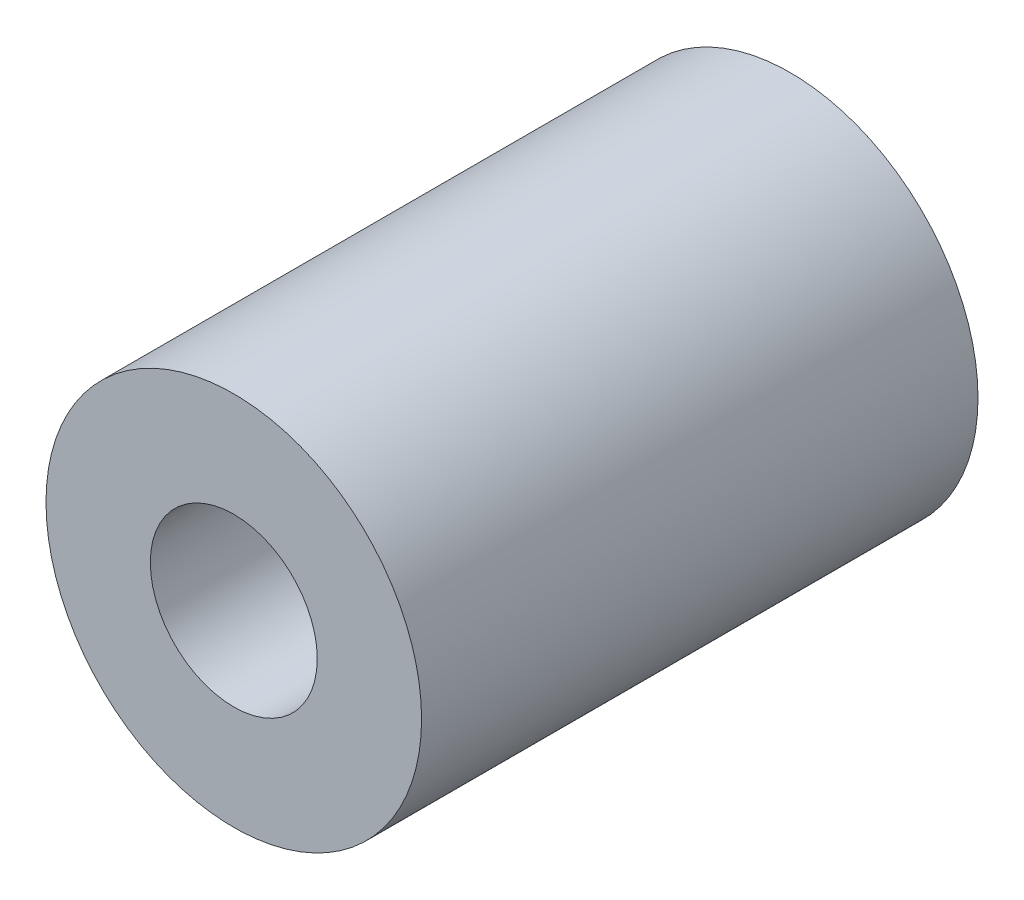
ISO-10303-21;
HEADER;
FILE_DESCRIPTION(('STEP AP214'),'2;1');
FILE_NAME('part.step','',(''),(''),'','','');
FILE_SCHEMA(('AUTOMOTIVE_DESIGN { 1 0 10303 214 1 1 1 1 }'));
ENDSEC;
DATA;
#1=APPLICATION_CONTEXT('core data for automotive mechanical design processes');
#2=APPLICATION_PROTOCOL_DEFINITION('international standard','automotive_design',2000,#1);
#3=PRODUCT_CONTEXT('',#1,'mechanical');
#4=PRODUCT('Part','Part','',(#3));
#5=PRODUCT_RELATED_PRODUCT_CATEGORY('part','',(#4));
#6=PRODUCT_DEFINITION_FORMATION('','',#4);
#7=PRODUCT_DEFINITION_CONTEXT('part definition',#1,'design');
#8=PRODUCT_DEFINITION('design','',#6,#7);
#9=PRODUCT_DEFINITION_SHAPE('','',#8);
#10=(LENGTH_UNIT() NAMED_UNIT(*) SI_UNIT(.MILLI.,.METRE.));
#11=(NAMED_UNIT(*) PLANE_ANGLE_UNIT() SI_UNIT($,.RADIAN.));
#12=(NAMED_UNIT(*) SI_UNIT($,.STERADIAN.) SOLID_ANGLE_UNIT());
#13=UNCERTAINTY_MEASURE_WITH_UNIT(LENGTH_MEASURE(1.E-05),#10,'distance_accuracy_value','');
#14=(GEOMETRIC_REPRESENTATION_CONTEXT(3) GLOBAL_UNCERTAINTY_ASSIGNED_CONTEXT((#13)) GLOBAL_UNIT_ASSIGNED_CONTEXT((#10,
#11,#12)) REPRESENTATION_CONTEXT('',''));
#15=CARTESIAN_POINT('',(0.,0.,0.));
#16=DIRECTION('',(0.,0.,1.));
#17=DIRECTION('',(1.,0.,0.));
#18=AXIS2_PLACEMENT_3D('',#15,#16,#17);
#19=CARTESIAN_POINT('',(0.,0.,40.));
#20=DIRECTION('',(0.,0.,-1.));
#21=DIRECTION('',(-1.,0.,0.));
#22=AXIS2_PLACEMENT_3D('',#19,#20,#21);
#23=CYLINDRICAL_SURFACE('',#22,13.5);
#24=CARTESIAN_POINT('',(0.,0.,40.));
#25=DIRECTION('',(0.,0.,1.));
#26=DIRECTION('',(1.,0.,0.));
#27=AXIS2_PLACEMENT_3D('',#24,#25,#26);
#28=CIRCLE('',#27,13.5);
#29=CARTESIAN_POINT('',(13.5,0.,40.));
#30=VERTEX_POINT('',#29);
#31=EDGE_CURVE('E10',#30,#30,#28,.T.);
#32=ORIENTED_EDGE('',*,*,#31,.F.);
#33=EDGE_LOOP('',(#32));
#34=FACE_BOUND('',#33,.T.);
#35=CARTESIAN_POINT('',(0.,0.,0.));
#36=DIRECTION('',(0.,0.,1.));
#37=DIRECTION('',(1.,0.,0.));
#38=AXIS2_PLACEMENT_3D('',#35,#36,#37);
#39=CIRCLE('',#38,13.5);
#40=CARTESIAN_POINT('',(13.5,0.,0.));
#41=VERTEX_POINT('',#40);
#42=EDGE_CURVE('E34',#41,#41,#39,.T.);
#43=ORIENTED_EDGE('',*,*,#42,.T.);
#44=EDGE_LOOP('',(#43));
#45=FACE_BOUND('',#44,.T.);
#46=ADVANCED_FACE('F31',(#34,#45),#23,.T.);
#47=CARTESIAN_POINT('',(0.,0.,40.));
#48=DIRECTION('',(0.,0.,1.));
#49=DIRECTION('',(1.,0.,0.));
#50=AXIS2_PLACEMENT_3D('',#47,#48,#49);
#51=PLANE('',#50);
#52=CARTESIAN_POINT('',(0.,0.,40.));
#53=DIRECTION('',(0.,0.,1.));
#54=DIRECTION('',(1.,0.,0.));
#55=AXIS2_PLACEMENT_3D('',#52,#53,#54);
#56=CIRCLE('',#55,6.);
#57=CARTESIAN_POINT('',(6.,0.,40.));
#58=VERTEX_POINT('',#57);
#59=EDGE_CURVE('E43',#58,#58,#56,.T.);
#60=ORIENTED_EDGE('',*,*,#59,.F.);
#61=EDGE_LOOP('',(#60));
#62=FACE_BOUND('',#61,.T.);
#63=ORIENTED_EDGE('',*,*,#31,.T.);
#64=EDGE_LOOP('',(#63));
#65=FACE_BOUND('',#64,.T.);
#66=ADVANCED_FACE('F58',(#62,#65),#51,.T.);
#67=CARTESIAN_POINT('',(0.,0.,0.));
#68=DIRECTION('',(0.,0.,1.));
#69=DIRECTION('',(1.,0.,0.));
#70=AXIS2_PLACEMENT_3D('',#67,#68,#69);
#71=PLANE('',#70);
#72=CARTESIAN_POINT('',(0.,0.,0.));
#73=DIRECTION('',(0.,0.,1.));
#74=DIRECTION('',(1.,0.,0.));
#75=AXIS2_PLACEMENT_3D('',#72,#73,#74);
#76=CIRCLE('',#75,6.);
#77=CARTESIAN_POINT('',(6.,0.,0.));
#78=VERTEX_POINT('',#77);
#79=EDGE_CURVE('E41',#78,#78,#76,.T.);
#80=ORIENTED_EDGE('',*,*,#79,.T.);
#81=EDGE_LOOP('',(#80));
#82=FACE_BOUND('',#81,.T.);
#83=ORIENTED_EDGE('',*,*,#42,.F.);
#84=EDGE_LOOP('',(#83));
#85=FACE_BOUND('',#84,.T.);
#86=ADVANCED_FACE('F49',(#82,#85),#71,.F.);
#87=CARTESIAN_POINT('',(0.,0.,0.));
#88=DIRECTION('',(0.,0.,1.));
#89=DIRECTION('',(1.,0.,0.));
#90=AXIS2_PLACEMENT_3D('',#87,#88,#89);
#91=CYLINDRICAL_SURFACE('',#90,6.);
#92=ORIENTED_EDGE('',*,*,#79,.F.);
#93=EDGE_LOOP('',(#92));
#94=FACE_BOUND('',#93,.T.);
#95=ORIENTED_EDGE('',*,*,#59,.T.);
#96=EDGE_LOOP('',(#95));
#97=FACE_BOUND('',#96,.T.);
#98=ADVANCED_FACE('F52',(#94,#97),#91,.F.);
#99=CLOSED_SHELL('',(#46,#66,#86,#98));
#100=MANIFOLD_SOLID_BREP('B2',#99);
#101=ADVANCED_BREP_SHAPE_REPRESENTATION('',(#18,#100),#14);
#102=SHAPE_DEFINITION_REPRESENTATION(#9,#101);
ENDSEC;
END-ISO-10303-21;
